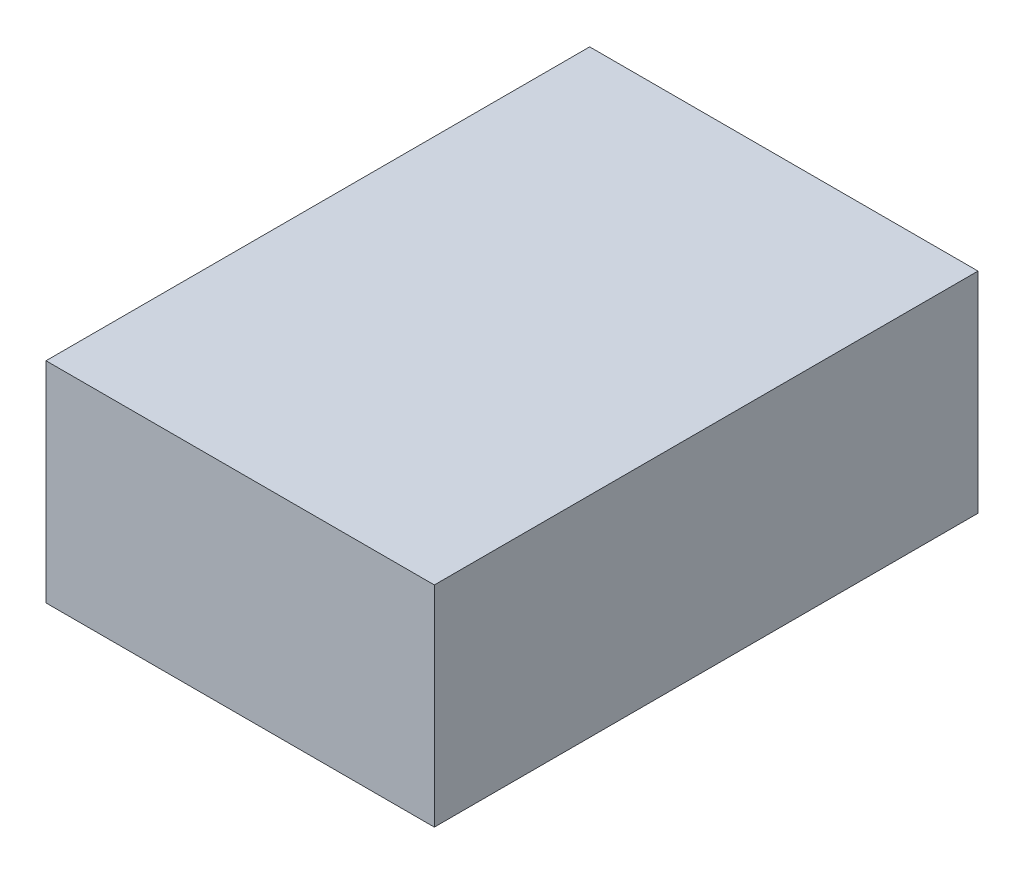
ISO-10303-21;
HEADER;
FILE_DESCRIPTION(('STEP AP214'),'2;1');
FILE_NAME('part.step','',(''),(''),'','','');
FILE_SCHEMA(('AUTOMOTIVE_DESIGN { 1 0 10303 214 1 1 1 1 }'));
ENDSEC;
DATA;
#1=APPLICATION_CONTEXT('core data for automotive mechanical design processes');
#2=APPLICATION_PROTOCOL_DEFINITION('international standard','automotive_design',2000,#1);
#3=PRODUCT_CONTEXT('',#1,'mechanical');
#4=PRODUCT('Part','Part','',(#3));
#5=PRODUCT_RELATED_PRODUCT_CATEGORY('part','',(#4));
#6=PRODUCT_DEFINITION_FORMATION('','',#4);
#7=PRODUCT_DEFINITION_CONTEXT('part definition',#1,'design');
#8=PRODUCT_DEFINITION('design','',#6,#7);
#9=PRODUCT_DEFINITION_SHAPE('','',#8);
#10=(LENGTH_UNIT() NAMED_UNIT(*) SI_UNIT(.MILLI.,.METRE.));
#11=(NAMED_UNIT(*) PLANE_ANGLE_UNIT() SI_UNIT($,.RADIAN.));
#12=(NAMED_UNIT(*) SI_UNIT($,.STERADIAN.) SOLID_ANGLE_UNIT());
#13=UNCERTAINTY_MEASURE_WITH_UNIT(LENGTH_MEASURE(1.E-05),#10,'distance_accuracy_value','');
#14=(GEOMETRIC_REPRESENTATION_CONTEXT(3) GLOBAL_UNCERTAINTY_ASSIGNED_CONTEXT((#13)) GLOBAL_UNIT_ASSIGNED_CONTEXT((#10,
#11,#12)) REPRESENTATION_CONTEXT('',''));
#15=CARTESIAN_POINT('',(0.,0.,0.));
#16=DIRECTION('',(0.,0.,1.));
#17=DIRECTION('',(1.,0.,0.));
#18=AXIS2_PLACEMENT_3D('',#15,#16,#17);
#19=CARTESIAN_POINT('',(6.35,3.43,17.78));
#20=DIRECTION('',(-1.,0.,0.));
#21=DIRECTION('',(0.,0.,1.));
#22=AXIS2_PLACEMENT_3D('',#19,#20,#21);
#23=PLANE('',#22);
#24=DIRECTION('',(0.,1.,0.));
#25=VECTOR('',#24,1.);
#26=CARTESIAN_POINT('',(6.35,3.43,0.));
#27=LINE('',#26,#25);
#28=CARTESIAN_POINT('',(6.35,-3.43,0.));
#29=VERTEX_POINT('',#28);
#30=CARTESIAN_POINT('',(6.35,3.43,0.));
#31=VERTEX_POINT('',#30);
#32=EDGE_CURVE('E107',#29,#31,#27,.T.);
#33=ORIENTED_EDGE('',*,*,#32,.T.);
#34=DIRECTION('',(0.,0.,-1.));
#35=VECTOR('',#34,1.);
#36=CARTESIAN_POINT('',(6.35,3.43,17.78));
#37=LINE('',#36,#35);
#38=CARTESIAN_POINT('',(6.35,3.43,17.78));
#39=VERTEX_POINT('',#38);
#40=EDGE_CURVE('E11',#39,#31,#37,.T.);
#41=ORIENTED_EDGE('',*,*,#40,.F.);
#42=DIRECTION('',(0.,1.,0.));
#43=VECTOR('',#42,1.);
#44=CARTESIAN_POINT('',(6.35,3.43,17.78));
#45=LINE('',#44,#43);
#46=CARTESIAN_POINT('',(6.35,-3.43,17.78));
#47=VERTEX_POINT('',#46);
#48=EDGE_CURVE('E91',#47,#39,#45,.T.);
#49=ORIENTED_EDGE('',*,*,#48,.F.);
#50=DIRECTION('',(0.,0.,-1.));
#51=VECTOR('',#50,1.);
#52=CARTESIAN_POINT('',(6.35,-3.43,17.78));
#53=LINE('',#52,#51);
#54=EDGE_CURVE('E103',#47,#29,#53,.T.);
#55=ORIENTED_EDGE('',*,*,#54,.T.);
#56=EDGE_LOOP('',(#33,#41,#49,#55));
#57=FACE_BOUND('',#56,.T.);
#58=ADVANCED_FACE('F39',(#57),#23,.F.);
#59=CARTESIAN_POINT('',(-6.35,3.43,17.78));
#60=DIRECTION('',(0.,-1.,0.));
#61=DIRECTION('',(0.,0.,-1.));
#62=AXIS2_PLACEMENT_3D('',#59,#60,#61);
#63=PLANE('',#62);
#64=DIRECTION('',(-1.,0.,0.));
#65=VECTOR('',#64,1.);
#66=CARTESIAN_POINT('',(-6.35,3.43,0.));
#67=LINE('',#66,#65);
#68=CARTESIAN_POINT('',(-6.35,3.43,0.));
#69=VERTEX_POINT('',#68);
#70=EDGE_CURVE('E96',#31,#69,#67,.T.);
#71=ORIENTED_EDGE('',*,*,#70,.T.);
#72=DIRECTION('',(0.,0.,-1.));
#73=VECTOR('',#72,1.);
#74=CARTESIAN_POINT('',(-6.35,3.43,17.78));
#75=LINE('',#74,#73);
#76=CARTESIAN_POINT('',(-6.35,3.43,17.78));
#77=VERTEX_POINT('',#76);
#78=EDGE_CURVE('E48',#77,#69,#75,.T.);
#79=ORIENTED_EDGE('',*,*,#78,.F.);
#80=DIRECTION('',(-1.,0.,0.));
#81=VECTOR('',#80,1.);
#82=CARTESIAN_POINT('',(-6.35,3.43,17.78));
#83=LINE('',#82,#81);
#84=EDGE_CURVE('E86',#39,#77,#83,.T.);
#85=ORIENTED_EDGE('',*,*,#84,.F.);
#86=ORIENTED_EDGE('',*,*,#40,.T.);
#87=EDGE_LOOP('',(#71,#79,#85,#86));
#88=FACE_BOUND('',#87,.T.);
#89=ADVANCED_FACE('F95',(#88),#63,.F.);
#90=CARTESIAN_POINT('',(-6.35,3.43,17.78));
#91=DIRECTION('',(1.,0.,0.));
#92=DIRECTION('',(0.,0.,-1.));
#93=AXIS2_PLACEMENT_3D('',#90,#91,#92);
#94=PLANE('',#93);
#95=DIRECTION('',(0.,-1.,0.));
#96=VECTOR('',#95,1.);
#97=CARTESIAN_POINT('',(-6.35,3.43,0.));
#98=LINE('',#97,#96);
#99=CARTESIAN_POINT('',(-6.35,-3.43,0.));
#100=VERTEX_POINT('',#99);
#101=EDGE_CURVE('E73',#69,#100,#98,.T.);
#102=ORIENTED_EDGE('',*,*,#101,.T.);
#103=DIRECTION('',(0.,0.,-1.));
#104=VECTOR('',#103,1.);
#105=CARTESIAN_POINT('',(-6.35,-3.43,17.78));
#106=LINE('',#105,#104);
#107=CARTESIAN_POINT('',(-6.35,-3.43,17.78));
#108=VERTEX_POINT('',#107);
#109=EDGE_CURVE('E98',#108,#100,#106,.T.);
#110=ORIENTED_EDGE('',*,*,#109,.F.);
#111=DIRECTION('',(0.,-1.,0.));
#112=VECTOR('',#111,1.);
#113=CARTESIAN_POINT('',(-6.35,3.43,17.78));
#114=LINE('',#113,#112);
#115=EDGE_CURVE('E89',#77,#108,#114,.T.);
#116=ORIENTED_EDGE('',*,*,#115,.F.);
#117=ORIENTED_EDGE('',*,*,#78,.T.);
#118=EDGE_LOOP('',(#102,#110,#116,#117));
#119=FACE_BOUND('',#118,.T.);
#120=ADVANCED_FACE('F99',(#119),#94,.F.);
#121=CARTESIAN_POINT('',(-6.35,-3.43,17.78));
#122=DIRECTION('',(0.,1.,0.));
#123=DIRECTION('',(0.,0.,1.));
#124=AXIS2_PLACEMENT_3D('',#121,#122,#123);
#125=PLANE('',#124);
#126=DIRECTION('',(1.,0.,0.));
#127=VECTOR('',#126,1.);
#128=CARTESIAN_POINT('',(-6.35,-3.43,0.));
#129=LINE('',#128,#127);
#130=EDGE_CURVE('E79',#100,#29,#129,.T.);
#131=ORIENTED_EDGE('',*,*,#130,.T.);
#132=ORIENTED_EDGE('',*,*,#54,.F.);
#133=DIRECTION('',(1.,0.,0.));
#134=VECTOR('',#133,1.);
#135=CARTESIAN_POINT('',(-6.35,-3.43,17.78));
#136=LINE('',#135,#134);
#137=EDGE_CURVE('E56',#108,#47,#136,.T.);
#138=ORIENTED_EDGE('',*,*,#137,.F.);
#139=ORIENTED_EDGE('',*,*,#109,.T.);
#140=EDGE_LOOP('',(#131,#132,#138,#139));
#141=FACE_BOUND('',#140,.T.);
#142=ADVANCED_FACE('F120',(#141),#125,.F.);
#143=CARTESIAN_POINT('',(0.,0.,17.78));
#144=DIRECTION('',(0.,0.,1.));
#145=DIRECTION('',(1.,0.,0.));
#146=AXIS2_PLACEMENT_3D('',#143,#144,#145);
#147=PLANE('',#146);
#148=ORIENTED_EDGE('',*,*,#48,.T.);
#149=ORIENTED_EDGE('',*,*,#84,.T.);
#150=ORIENTED_EDGE('',*,*,#115,.T.);
#151=ORIENTED_EDGE('',*,*,#137,.T.);
#152=EDGE_LOOP('',(#148,#149,#150,#151));
#153=FACE_BOUND('',#152,.T.);
#154=ADVANCED_FACE('F87',(#153),#147,.T.);
#155=CARTESIAN_POINT('',(0.,0.,0.));
#156=DIRECTION('',(0.,0.,1.));
#157=DIRECTION('',(1.,0.,0.));
#158=AXIS2_PLACEMENT_3D('',#155,#156,#157);
#159=PLANE('',#158);
#160=ORIENTED_EDGE('',*,*,#32,.F.);
#161=ORIENTED_EDGE('',*,*,#130,.F.);
#162=ORIENTED_EDGE('',*,*,#101,.F.);
#163=ORIENTED_EDGE('',*,*,#70,.F.);
#164=EDGE_LOOP('',(#160,#161,#162,#163));
#165=FACE_BOUND('',#164,.T.);
#166=ADVANCED_FACE('F123',(#165),#159,.F.);
#167=CLOSED_SHELL('',(#58,#89,#120,#142,#154,#166));
#168=MANIFOLD_SOLID_BREP('B2',#167);
#169=ADVANCED_BREP_SHAPE_REPRESENTATION('',(#18,#168),#14);
#170=SHAPE_DEFINITION_REPRESENTATION(#9,#169);
ENDSEC;
END-ISO-10303-21;
